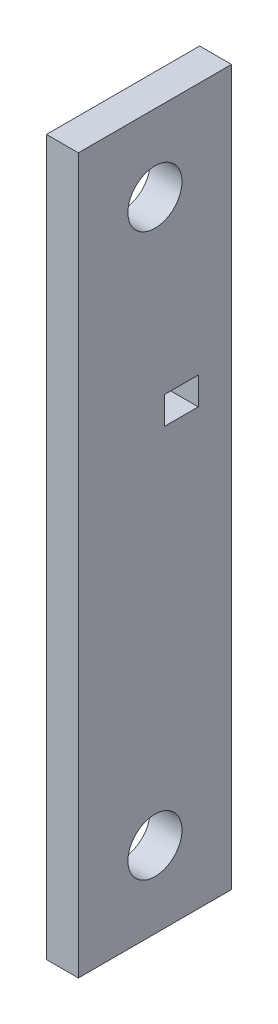
ISO-10303-21;
HEADER;
FILE_DESCRIPTION(('STEP AP214'),'2;1');
FILE_NAME('part.step','',(''),(''),'','','');
FILE_SCHEMA(('AUTOMOTIVE_DESIGN { 1 0 10303 214 1 1 1 1 }'));
ENDSEC;
DATA;
#1=APPLICATION_CONTEXT('core data for automotive mechanical design processes');
#2=APPLICATION_PROTOCOL_DEFINITION('international standard','automotive_design',2000,#1);
#3=PRODUCT_CONTEXT('',#1,'mechanical');
#4=PRODUCT('Part','Part','',(#3));
#5=PRODUCT_RELATED_PRODUCT_CATEGORY('part','',(#4));
#6=PRODUCT_DEFINITION_FORMATION('','',#4);
#7=PRODUCT_DEFINITION_CONTEXT('part definition',#1,'design');
#8=PRODUCT_DEFINITION('design','',#6,#7);
#9=PRODUCT_DEFINITION_SHAPE('','',#8);
#10=(LENGTH_UNIT() NAMED_UNIT(*) SI_UNIT(.MILLI.,.METRE.));
#11=(NAMED_UNIT(*) PLANE_ANGLE_UNIT() SI_UNIT($,.RADIAN.));
#12=(NAMED_UNIT(*) SI_UNIT($,.STERADIAN.) SOLID_ANGLE_UNIT());
#13=UNCERTAINTY_MEASURE_WITH_UNIT(LENGTH_MEASURE(1.E-05),#10,'distance_accuracy_value','');
#14=(GEOMETRIC_REPRESENTATION_CONTEXT(3) GLOBAL_UNCERTAINTY_ASSIGNED_CONTEXT((#13)) GLOBAL_UNIT_ASSIGNED_CONTEXT((#10,
#11,#12)) REPRESENTATION_CONTEXT('',''));
#15=CARTESIAN_POINT('',(0.,0.,0.));
#16=DIRECTION('',(0.,0.,1.));
#17=DIRECTION('',(1.,0.,0.));
#18=AXIS2_PLACEMENT_3D('',#15,#16,#17);
#19=CARTESIAN_POINT('',(3.96875,-88.9,19.05));
#20=DIRECTION('',(-1.,0.,0.));
#21=DIRECTION('',(0.,0.,1.));
#22=AXIS2_PLACEMENT_3D('',#19,#20,#21);
#23=PLANE('',#22);
#24=DIRECTION('',(0.,0.,-1.));
#25=VECTOR('',#24,1.);
#26=CARTESIAN_POINT('',(3.96875,19.2532,-2.39521999999998));
#27=LINE('',#26,#25);
#28=CARTESIAN_POINT('',(3.96875,19.2532,-2.39521999999998));
#29=VERTEX_POINT('',#28);
#30=CARTESIAN_POINT('',(3.96875,19.2532,-10.77722));
#31=VERTEX_POINT('',#30);
#32=EDGE_CURVE('E108',#29,#31,#27,.T.);
#33=ORIENTED_EDGE('',*,*,#32,.F.);
#34=DIRECTION('',(0.,-1.,0.));
#35=VECTOR('',#34,1.);
#36=CARTESIAN_POINT('',(3.96875,26.1112,-2.39521999999998));
#37=LINE('',#36,#35);
#38=CARTESIAN_POINT('',(3.96875,26.1112,-2.39521999999998));
#39=VERTEX_POINT('',#38);
#40=EDGE_CURVE('E48',#39,#29,#37,.T.);
#41=ORIENTED_EDGE('',*,*,#40,.F.);
#42=DIRECTION('',(0.,0.,1.));
#43=VECTOR('',#42,1.);
#44=CARTESIAN_POINT('',(3.96875,26.1112,-10.77722));
#45=LINE('',#44,#43);
#46=CARTESIAN_POINT('',(3.96875,26.1112,-10.77722));
#47=VERTEX_POINT('',#46);
#48=EDGE_CURVE('E114',#47,#39,#45,.T.);
#49=ORIENTED_EDGE('',*,*,#48,.F.);
#50=DIRECTION('',(0.,1.,0.));
#51=VECTOR('',#50,1.);
#52=CARTESIAN_POINT('',(3.96875,19.2532,-10.77722));
#53=LINE('',#52,#51);
#54=EDGE_CURVE('E99',#31,#47,#53,.T.);
#55=ORIENTED_EDGE('',*,*,#54,.F.);
#56=EDGE_LOOP('',(#33,#41,#49,#55));
#57=FACE_BOUND('',#56,.T.);
#58=CARTESIAN_POINT('',(3.96875,-69.85,0.));
#59=DIRECTION('',(1.,0.,0.));
#60=DIRECTION('',(0.,0.,-1.));
#61=AXIS2_PLACEMENT_3D('',#58,#59,#60);
#62=CIRCLE('',#61,6.731);
#63=CARTESIAN_POINT('',(3.96875,-69.85,-6.731));
#64=VERTEX_POINT('',#63);
#65=EDGE_CURVE('E130',#64,#64,#62,.T.);
#66=ORIENTED_EDGE('',*,*,#65,.F.);
#67=EDGE_LOOP('',(#66));
#68=FACE_BOUND('',#67,.T.);
#69=CARTESIAN_POINT('',(3.96875,69.85,0.));
#70=DIRECTION('',(1.,0.,0.));
#71=DIRECTION('',(0.,0.,-1.));
#72=AXIS2_PLACEMENT_3D('',#69,#70,#71);
#73=CIRCLE('',#72,6.731);
#74=CARTESIAN_POINT('',(3.96875,69.85,-6.731));
#75=VERTEX_POINT('',#74);
#76=EDGE_CURVE('E135',#75,#75,#73,.T.);
#77=ORIENTED_EDGE('',*,*,#76,.F.);
#78=EDGE_LOOP('',(#77));
#79=FACE_BOUND('',#78,.T.);
#80=DIRECTION('',(0.,1.,0.));
#81=VECTOR('',#80,1.);
#82=CARTESIAN_POINT('',(3.96875,-88.9,-19.05));
#83=LINE('',#82,#81);
#84=CARTESIAN_POINT('',(3.96875,-88.9,-19.05));
#85=VERTEX_POINT('',#84);
#86=CARTESIAN_POINT('',(3.96875,88.9,-19.05));
#87=VERTEX_POINT('',#86);
#88=EDGE_CURVE('E139',#85,#87,#83,.T.);
#89=ORIENTED_EDGE('',*,*,#88,.T.);
#90=DIRECTION('',(0.,0.,-1.));
#91=VECTOR('',#90,1.);
#92=CARTESIAN_POINT('',(3.96875,88.9,19.05));
#93=LINE('',#92,#91);
#94=CARTESIAN_POINT('',(3.96875,88.9,19.05));
#95=VERTEX_POINT('',#94);
#96=EDGE_CURVE('E11',#95,#87,#93,.T.);
#97=ORIENTED_EDGE('',*,*,#96,.F.);
#98=DIRECTION('',(0.,1.,0.));
#99=VECTOR('',#98,1.);
#100=CARTESIAN_POINT('',(3.96875,-88.9,19.05));
#101=LINE('',#100,#99);
#102=CARTESIAN_POINT('',(3.96875,-88.9,19.05));
#103=VERTEX_POINT('',#102);
#104=EDGE_CURVE('E151',#103,#95,#101,.T.);
#105=ORIENTED_EDGE('',*,*,#104,.F.);
#106=DIRECTION('',(0.,0.,-1.));
#107=VECTOR('',#106,1.);
#108=CARTESIAN_POINT('',(3.96875,-88.9,19.05));
#109=LINE('',#108,#107);
#110=EDGE_CURVE('E162',#103,#85,#109,.T.);
#111=ORIENTED_EDGE('',*,*,#110,.T.);
#112=EDGE_LOOP('',(#89,#97,#105,#111));
#113=FACE_BOUND('',#112,.T.);
#114=ADVANCED_FACE('F32',(#57,#68,#79,#113),#23,.F.);
#115=CARTESIAN_POINT('',(-3.96875,88.9,19.05));
#116=DIRECTION('',(0.,1.,0.));
#117=DIRECTION('',(0.,0.,1.));
#118=AXIS2_PLACEMENT_3D('',#115,#116,#117);
#119=PLANE('',#118);
#120=DIRECTION('',(1.,0.,0.));
#121=VECTOR('',#120,1.);
#122=CARTESIAN_POINT('',(-3.96875,88.9,-19.05));
#123=LINE('',#122,#121);
#124=CARTESIAN_POINT('',(-3.96875,88.9,-19.05));
#125=VERTEX_POINT('',#124);
#126=EDGE_CURVE('E142',#125,#87,#123,.T.);
#127=ORIENTED_EDGE('',*,*,#126,.F.);
#128=DIRECTION('',(0.,0.,-1.));
#129=VECTOR('',#128,1.);
#130=CARTESIAN_POINT('',(-3.96875,88.9,19.05));
#131=LINE('',#130,#129);
#132=CARTESIAN_POINT('',(-3.96875,88.9,19.05));
#133=VERTEX_POINT('',#132);
#134=EDGE_CURVE('E40',#133,#125,#131,.T.);
#135=ORIENTED_EDGE('',*,*,#134,.F.);
#136=DIRECTION('',(1.,0.,0.));
#137=VECTOR('',#136,1.);
#138=CARTESIAN_POINT('',(-3.96875,88.9,19.05));
#139=LINE('',#138,#137);
#140=EDGE_CURVE('E153',#133,#95,#139,.T.);
#141=ORIENTED_EDGE('',*,*,#140,.T.);
#142=ORIENTED_EDGE('',*,*,#96,.T.);
#143=EDGE_LOOP('',(#127,#135,#141,#142));
#144=FACE_BOUND('',#143,.T.);
#145=ADVANCED_FACE('F176',(#144),#119,.T.);
#146=CARTESIAN_POINT('',(-3.96875,-88.9,19.05));
#147=DIRECTION('',(-1.,0.,0.));
#148=DIRECTION('',(0.,0.,1.));
#149=AXIS2_PLACEMENT_3D('',#146,#147,#148);
#150=PLANE('',#149);
#151=DIRECTION('',(0.,-1.,0.));
#152=VECTOR('',#151,1.);
#153=CARTESIAN_POINT('',(-3.96875,26.1112,-2.39521999999998));
#154=LINE('',#153,#152);
#155=CARTESIAN_POINT('',(-3.96875,26.1112,-2.39521999999998));
#156=VERTEX_POINT('',#155);
#157=CARTESIAN_POINT('',(-3.96875,19.2532,-2.39521999999998));
#158=VERTEX_POINT('',#157);
#159=EDGE_CURVE('E116',#156,#158,#154,.T.);
#160=ORIENTED_EDGE('',*,*,#159,.T.);
#161=DIRECTION('',(0.,0.,-1.));
#162=VECTOR('',#161,1.);
#163=CARTESIAN_POINT('',(-3.96875,19.2532,-2.39521999999998));
#164=LINE('',#163,#162);
#165=CARTESIAN_POINT('',(-3.96875,19.2532,-10.77722));
#166=VERTEX_POINT('',#165);
#167=EDGE_CURVE('E122',#158,#166,#164,.T.);
#168=ORIENTED_EDGE('',*,*,#167,.T.);
#169=DIRECTION('',(0.,1.,0.));
#170=VECTOR('',#169,1.);
#171=CARTESIAN_POINT('',(-3.96875,19.2532,-10.77722));
#172=LINE('',#171,#170);
#173=CARTESIAN_POINT('',(-3.96875,26.1112,-10.77722));
#174=VERTEX_POINT('',#173);
#175=EDGE_CURVE('E56',#166,#174,#172,.T.);
#176=ORIENTED_EDGE('',*,*,#175,.T.);
#177=DIRECTION('',(0.,0.,1.));
#178=VECTOR('',#177,1.);
#179=CARTESIAN_POINT('',(-3.96875,26.1112,-10.77722));
#180=LINE('',#179,#178);
#181=EDGE_CURVE('E125',#174,#156,#180,.T.);
#182=ORIENTED_EDGE('',*,*,#181,.T.);
#183=EDGE_LOOP('',(#160,#168,#176,#182));
#184=FACE_BOUND('',#183,.T.);
#185=CARTESIAN_POINT('',(-3.96875,-69.85,0.));
#186=DIRECTION('',(-1.,0.,0.));
#187=DIRECTION('',(0.,0.,1.));
#188=AXIS2_PLACEMENT_3D('',#185,#186,#187);
#189=CIRCLE('',#188,6.731);
#190=CARTESIAN_POINT('',(-3.96875,-69.85,6.731));
#191=VERTEX_POINT('',#190);
#192=EDGE_CURVE('E35',#191,#191,#189,.T.);
#193=ORIENTED_EDGE('',*,*,#192,.F.);
#194=EDGE_LOOP('',(#193));
#195=FACE_BOUND('',#194,.T.);
#196=CARTESIAN_POINT('',(-3.96875,69.85,0.));
#197=DIRECTION('',(-1.,0.,0.));
#198=DIRECTION('',(0.,0.,1.));
#199=AXIS2_PLACEMENT_3D('',#196,#197,#198);
#200=CIRCLE('',#199,6.731);
#201=CARTESIAN_POINT('',(-3.96875,69.85,6.731));
#202=VERTEX_POINT('',#201);
#203=EDGE_CURVE('E138',#202,#202,#200,.T.);
#204=ORIENTED_EDGE('',*,*,#203,.F.);
#205=EDGE_LOOP('',(#204));
#206=FACE_BOUND('',#205,.T.);
#207=DIRECTION('',(0.,1.,0.));
#208=VECTOR('',#207,1.);
#209=CARTESIAN_POINT('',(-3.96875,-88.9,-19.05));
#210=LINE('',#209,#208);
#211=CARTESIAN_POINT('',(-3.96875,-88.9,-19.05));
#212=VERTEX_POINT('',#211);
#213=EDGE_CURVE('E145',#212,#125,#210,.T.);
#214=ORIENTED_EDGE('',*,*,#213,.F.);
#215=DIRECTION('',(0.,0.,-1.));
#216=VECTOR('',#215,1.);
#217=CARTESIAN_POINT('',(-3.96875,-88.9,19.05));
#218=LINE('',#217,#216);
#219=CARTESIAN_POINT('',(-3.96875,-88.9,19.05));
#220=VERTEX_POINT('',#219);
#221=EDGE_CURVE('E164',#220,#212,#218,.T.);
#222=ORIENTED_EDGE('',*,*,#221,.F.);
#223=DIRECTION('',(0.,1.,0.));
#224=VECTOR('',#223,1.);
#225=CARTESIAN_POINT('',(-3.96875,-88.9,19.05));
#226=LINE('',#225,#224);
#227=EDGE_CURVE('E156',#220,#133,#226,.T.);
#228=ORIENTED_EDGE('',*,*,#227,.T.);
#229=ORIENTED_EDGE('',*,*,#134,.T.);
#230=EDGE_LOOP('',(#214,#222,#228,#229));
#231=FACE_BOUND('',#230,.T.);
#232=ADVANCED_FACE('F172',(#184,#195,#206,#231),#150,.T.);
#233=CARTESIAN_POINT('',(3.96875,-88.9,19.05));
#234=DIRECTION('',(0.,-1.,0.));
#235=DIRECTION('',(0.,0.,-1.));
#236=AXIS2_PLACEMENT_3D('',#233,#234,#235);
#237=PLANE('',#236);
#238=DIRECTION('',(-1.,0.,0.));
#239=VECTOR('',#238,1.);
#240=CARTESIAN_POINT('',(3.96875,-88.9,-19.05));
#241=LINE('',#240,#239);
#242=EDGE_CURVE('E148',#85,#212,#241,.T.);
#243=ORIENTED_EDGE('',*,*,#242,.F.);
#244=ORIENTED_EDGE('',*,*,#110,.F.);
#245=DIRECTION('',(-1.,0.,0.));
#246=VECTOR('',#245,1.);
#247=CARTESIAN_POINT('',(3.96875,-88.9,19.05));
#248=LINE('',#247,#246);
#249=EDGE_CURVE('E159',#103,#220,#248,.T.);
#250=ORIENTED_EDGE('',*,*,#249,.T.);
#251=ORIENTED_EDGE('',*,*,#221,.T.);
#252=EDGE_LOOP('',(#243,#244,#250,#251));
#253=FACE_BOUND('',#252,.T.);
#254=ADVANCED_FACE('F175',(#253),#237,.T.);
#255=CARTESIAN_POINT('',(3.96875,88.9,19.05));
#256=DIRECTION('',(0.,0.,-1.));
#257=DIRECTION('',(-1.,0.,0.));
#258=AXIS2_PLACEMENT_3D('',#255,#256,#257);
#259=PLANE('',#258);
#260=ORIENTED_EDGE('',*,*,#104,.T.);
#261=ORIENTED_EDGE('',*,*,#140,.F.);
#262=ORIENTED_EDGE('',*,*,#227,.F.);
#263=ORIENTED_EDGE('',*,*,#249,.F.);
#264=EDGE_LOOP('',(#260,#261,#262,#263));
#265=FACE_BOUND('',#264,.T.);
#266=ADVANCED_FACE('F190',(#265),#259,.F.);
#267=CARTESIAN_POINT('',(3.96875,88.9,-19.05));
#268=DIRECTION('',(0.,0.,-1.));
#269=DIRECTION('',(-1.,0.,0.));
#270=AXIS2_PLACEMENT_3D('',#267,#268,#269);
#271=PLANE('',#270);
#272=ORIENTED_EDGE('',*,*,#88,.F.);
#273=ORIENTED_EDGE('',*,*,#242,.T.);
#274=ORIENTED_EDGE('',*,*,#213,.T.);
#275=ORIENTED_EDGE('',*,*,#126,.T.);
#276=EDGE_LOOP('',(#272,#273,#274,#275));
#277=FACE_BOUND('',#276,.T.);
#278=ADVANCED_FACE('F185',(#277),#271,.T.);
#279=CARTESIAN_POINT('',(-5.08,69.85,0.));
#280=DIRECTION('',(1.,0.,0.));
#281=DIRECTION('',(0.,0.,-1.));
#282=AXIS2_PLACEMENT_3D('',#279,#280,#281);
#283=CYLINDRICAL_SURFACE('',#282,6.731);
#284=ORIENTED_EDGE('',*,*,#203,.T.);
#285=EDGE_LOOP('',(#284));
#286=FACE_BOUND('',#285,.T.);
#287=ORIENTED_EDGE('',*,*,#76,.T.);
#288=EDGE_LOOP('',(#287));
#289=FACE_BOUND('',#288,.T.);
#290=ADVANCED_FACE('F169',(#286,#289),#283,.F.);
#291=CARTESIAN_POINT('',(-5.08,-69.85,0.));
#292=DIRECTION('',(1.,0.,0.));
#293=DIRECTION('',(0.,0.,-1.));
#294=AXIS2_PLACEMENT_3D('',#291,#292,#293);
#295=CYLINDRICAL_SURFACE('',#294,6.731);
#296=ORIENTED_EDGE('',*,*,#192,.T.);
#297=EDGE_LOOP('',(#296));
#298=FACE_BOUND('',#297,.T.);
#299=ORIENTED_EDGE('',*,*,#65,.T.);
#300=EDGE_LOOP('',(#299));
#301=FACE_BOUND('',#300,.T.);
#302=ADVANCED_FACE('F210',(#298,#301),#295,.F.);
#303=CARTESIAN_POINT('',(-3.96875,26.1112,-2.39521999999998));
#304=DIRECTION('',(0.,0.,1.));
#305=DIRECTION('',(1.,0.,0.));
#306=AXIS2_PLACEMENT_3D('',#303,#304,#305);
#307=PLANE('',#306);
#308=DIRECTION('',(1.,0.,0.));
#309=VECTOR('',#308,1.);
#310=CARTESIAN_POINT('',(-3.96875,19.2532,-2.39521999999998));
#311=LINE('',#310,#309);
#312=EDGE_CURVE('E105',#158,#29,#311,.T.);
#313=ORIENTED_EDGE('',*,*,#312,.F.);
#314=ORIENTED_EDGE('',*,*,#159,.F.);
#315=DIRECTION('',(1.,0.,0.));
#316=VECTOR('',#315,1.);
#317=CARTESIAN_POINT('',(-3.96875,26.1112,-2.39521999999998));
#318=LINE('',#317,#316);
#319=EDGE_CURVE('E128',#156,#39,#318,.T.);
#320=ORIENTED_EDGE('',*,*,#319,.T.);
#321=ORIENTED_EDGE('',*,*,#40,.T.);
#322=EDGE_LOOP('',(#313,#314,#320,#321));
#323=FACE_BOUND('',#322,.T.);
#324=ADVANCED_FACE('F213',(#323),#307,.F.);
#325=CARTESIAN_POINT('',(-3.96875,26.1112,-10.77722));
#326=DIRECTION('',(0.,1.,0.));
#327=DIRECTION('',(0.,0.,1.));
#328=AXIS2_PLACEMENT_3D('',#325,#326,#327);
#329=PLANE('',#328);
#330=ORIENTED_EDGE('',*,*,#319,.F.);
#331=ORIENTED_EDGE('',*,*,#181,.F.);
#332=DIRECTION('',(1.,0.,0.));
#333=VECTOR('',#332,1.);
#334=CARTESIAN_POINT('',(-3.96875,26.1112,-10.77722));
#335=LINE('',#334,#333);
#336=EDGE_CURVE('E104',#174,#47,#335,.T.);
#337=ORIENTED_EDGE('',*,*,#336,.T.);
#338=ORIENTED_EDGE('',*,*,#48,.T.);
#339=EDGE_LOOP('',(#330,#331,#337,#338));
#340=FACE_BOUND('',#339,.T.);
#341=ADVANCED_FACE('F217',(#340),#329,.F.);
#342=CARTESIAN_POINT('',(-3.96875,19.2532,-10.77722));
#343=DIRECTION('',(0.,0.,-1.));
#344=DIRECTION('',(0.,1.,0.));
#345=AXIS2_PLACEMENT_3D('',#342,#343,#344);
#346=PLANE('',#345);
#347=ORIENTED_EDGE('',*,*,#336,.F.);
#348=ORIENTED_EDGE('',*,*,#175,.F.);
#349=DIRECTION('',(1.,0.,0.));
#350=VECTOR('',#349,1.);
#351=CARTESIAN_POINT('',(-3.96875,19.2532,-10.77722));
#352=LINE('',#351,#350);
#353=EDGE_CURVE('E95',#166,#31,#352,.T.);
#354=ORIENTED_EDGE('',*,*,#353,.T.);
#355=ORIENTED_EDGE('',*,*,#54,.T.);
#356=EDGE_LOOP('',(#347,#348,#354,#355));
#357=FACE_BOUND('',#356,.T.);
#358=ADVANCED_FACE('F97',(#357),#346,.F.);
#359=CARTESIAN_POINT('',(-3.96875,19.2532,-2.39521999999998));
#360=DIRECTION('',(0.,-1.,0.));
#361=DIRECTION('',(0.,0.,-1.));
#362=AXIS2_PLACEMENT_3D('',#359,#360,#361);
#363=PLANE('',#362);
#364=ORIENTED_EDGE('',*,*,#353,.F.);
#365=ORIENTED_EDGE('',*,*,#167,.F.);
#366=ORIENTED_EDGE('',*,*,#312,.T.);
#367=ORIENTED_EDGE('',*,*,#32,.T.);
#368=EDGE_LOOP('',(#364,#365,#366,#367));
#369=FACE_BOUND('',#368,.T.);
#370=ADVANCED_FACE('F109',(#369),#363,.F.);
#371=CLOSED_SHELL('',(#114,#145,#232,#254,#266,#278,#290,#302,#324,#341,#358,#370));
#372=MANIFOLD_SOLID_BREP('B2',#371);
#373=ADVANCED_BREP_SHAPE_REPRESENTATION('',(#18,#372),#14);
#374=SHAPE_DEFINITION_REPRESENTATION(#9,#373);
ENDSEC;
END-ISO-10303-21;
